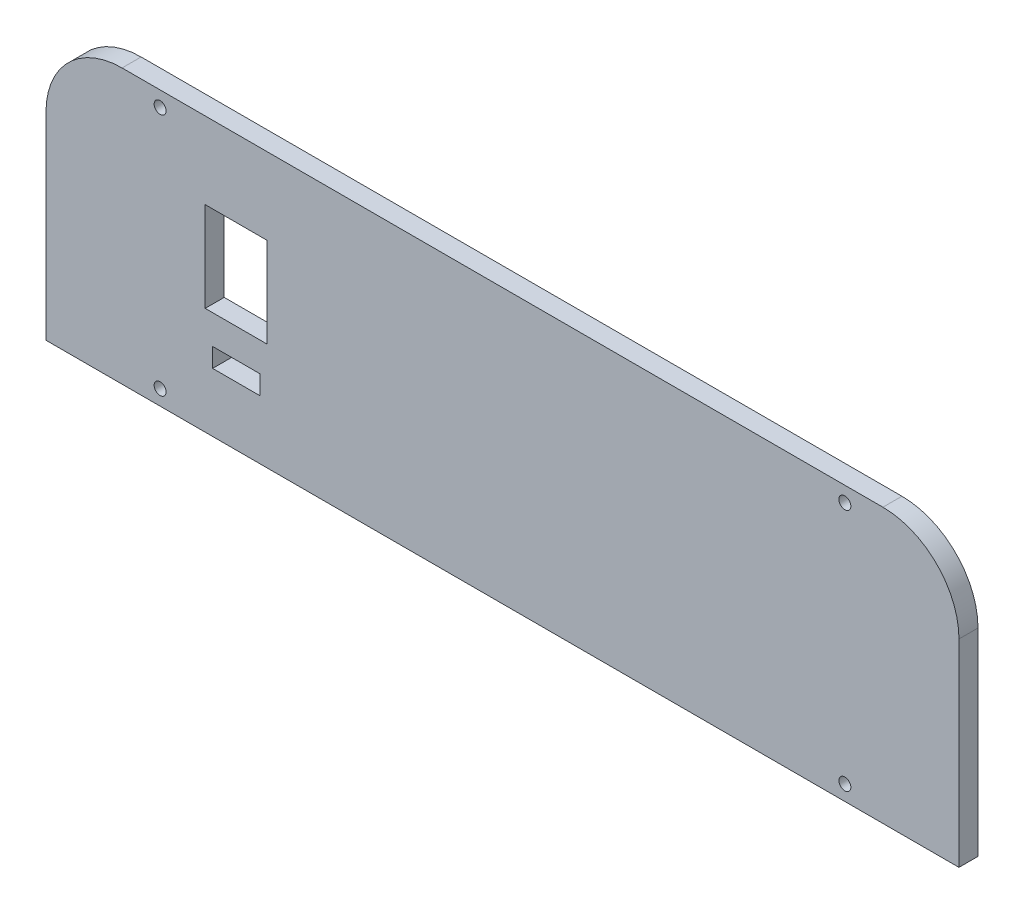
ISO-10303-21;
HEADER;
FILE_DESCRIPTION(('STEP AP214'),'2;1');
FILE_NAME('part.step','',(''),(''),'','','');
FILE_SCHEMA(('AUTOMOTIVE_DESIGN { 1 0 10303 214 1 1 1 1 }'));
ENDSEC;
DATA;
#1=APPLICATION_CONTEXT('core data for automotive mechanical design processes');
#2=APPLICATION_PROTOCOL_DEFINITION('international standard','automotive_design',2000,#1);
#3=PRODUCT_CONTEXT('',#1,'mechanical');
#4=PRODUCT('Part','Part','',(#3));
#5=PRODUCT_RELATED_PRODUCT_CATEGORY('part','',(#4));
#6=PRODUCT_DEFINITION_FORMATION('','',#4);
#7=PRODUCT_DEFINITION_CONTEXT('part definition',#1,'design');
#8=PRODUCT_DEFINITION('design','',#6,#7);
#9=PRODUCT_DEFINITION_SHAPE('','',#8);
#10=(LENGTH_UNIT() NAMED_UNIT(*) SI_UNIT(.MILLI.,.METRE.));
#11=(NAMED_UNIT(*) PLANE_ANGLE_UNIT() SI_UNIT($,.RADIAN.));
#12=(NAMED_UNIT(*) SI_UNIT($,.STERADIAN.) SOLID_ANGLE_UNIT());
#13=UNCERTAINTY_MEASURE_WITH_UNIT(LENGTH_MEASURE(1.E-05),#10,'distance_accuracy_value','');
#14=(GEOMETRIC_REPRESENTATION_CONTEXT(3) GLOBAL_UNCERTAINTY_ASSIGNED_CONTEXT((#13)) GLOBAL_UNIT_ASSIGNED_CONTEXT((#10,
#11,#12)) REPRESENTATION_CONTEXT('',''));
#15=CARTESIAN_POINT('',(0.,0.,0.));
#16=DIRECTION('',(0.,0.,1.));
#17=DIRECTION('',(1.,0.,0.));
#18=AXIS2_PLACEMENT_3D('',#15,#16,#17);
#19=CARTESIAN_POINT('',(76.2,-22.86,3.175));
#20=DIRECTION('',(-1.,0.,0.));
#21=DIRECTION('',(0.,0.,1.));
#22=AXIS2_PLACEMENT_3D('',#19,#20,#21);
#23=PLANE('',#22);
#24=DIRECTION('',(0.,1.,0.));
#25=VECTOR('',#24,1.);
#26=CARTESIAN_POINT('',(76.2,-22.86,0.));
#27=LINE('',#26,#25);
#28=CARTESIAN_POINT('',(76.2,-22.86,0.));
#29=VERTEX_POINT('',#28);
#30=CARTESIAN_POINT('',(76.2,10.16,0.));
#31=VERTEX_POINT('',#30);
#32=EDGE_CURVE('E224',#29,#31,#27,.T.);
#33=ORIENTED_EDGE('',*,*,#32,.T.);
#34=DIRECTION('',(0.,0.,-1.));
#35=VECTOR('',#34,1.);
#36=CARTESIAN_POINT('',(76.2,10.16,3.175));
#37=LINE('',#36,#35);
#38=CARTESIAN_POINT('',(76.2,10.16,3.175));
#39=VERTEX_POINT('',#38);
#40=EDGE_CURVE('E261',#31,#39,#37,.F.);
#41=ORIENTED_EDGE('',*,*,#40,.T.);
#42=DIRECTION('',(0.,1.,0.));
#43=VECTOR('',#42,1.);
#44=CARTESIAN_POINT('',(76.2,-22.86,3.175));
#45=LINE('',#44,#43);
#46=CARTESIAN_POINT('',(76.2,-22.86,3.175));
#47=VERTEX_POINT('',#46);
#48=EDGE_CURVE('E227',#47,#39,#45,.T.);
#49=ORIENTED_EDGE('',*,*,#48,.F.);
#50=DIRECTION('',(0.,0.,-1.));
#51=VECTOR('',#50,1.);
#52=CARTESIAN_POINT('',(76.2,-22.86,3.175));
#53=LINE('',#52,#51);
#54=EDGE_CURVE('E238',#47,#29,#53,.T.);
#55=ORIENTED_EDGE('',*,*,#54,.T.);
#56=EDGE_LOOP('',(#33,#41,#49,#55));
#57=FACE_BOUND('',#56,.T.);
#58=ADVANCED_FACE('F33',(#57),#23,.F.);
#59=CARTESIAN_POINT('',(-76.2,22.86,3.175));
#60=DIRECTION('',(0.,-1.,0.));
#61=DIRECTION('',(0.,0.,-1.));
#62=AXIS2_PLACEMENT_3D('',#59,#60,#61);
#63=PLANE('',#62);
#64=DIRECTION('',(-1.,0.,0.));
#65=VECTOR('',#64,1.);
#66=CARTESIAN_POINT('',(-76.2,22.86,3.175));
#67=LINE('',#66,#65);
#68=CARTESIAN_POINT('',(63.4999999999999,22.86,3.175));
#69=VERTEX_POINT('',#68);
#70=CARTESIAN_POINT('',(-63.5,22.86,3.175));
#71=VERTEX_POINT('',#70);
#72=EDGE_CURVE('E230',#69,#71,#67,.T.);
#73=ORIENTED_EDGE('',*,*,#72,.F.);
#74=DIRECTION('',(0.,0.,-1.));
#75=VECTOR('',#74,1.);
#76=CARTESIAN_POINT('',(63.5,22.86,3.175));
#77=LINE('',#76,#75);
#78=CARTESIAN_POINT('',(63.4999999999999,22.86,0.));
#79=VERTEX_POINT('',#78);
#80=EDGE_CURVE('E254',#69,#79,#77,.T.);
#81=ORIENTED_EDGE('',*,*,#80,.T.);
#82=DIRECTION('',(-1.,0.,0.));
#83=VECTOR('',#82,1.);
#84=CARTESIAN_POINT('',(-76.2,22.86,0.));
#85=LINE('',#84,#83);
#86=CARTESIAN_POINT('',(-63.5,22.86,0.));
#87=VERTEX_POINT('',#86);
#88=EDGE_CURVE('E241',#79,#87,#85,.T.);
#89=ORIENTED_EDGE('',*,*,#88,.T.);
#90=DIRECTION('',(0.,0.,-1.));
#91=VECTOR('',#90,1.);
#92=CARTESIAN_POINT('',(-63.5,22.86,3.175));
#93=LINE('',#92,#91);
#94=EDGE_CURVE('E252',#87,#71,#93,.F.);
#95=ORIENTED_EDGE('',*,*,#94,.T.);
#96=EDGE_LOOP('',(#73,#81,#89,#95));
#97=FACE_BOUND('',#96,.T.);
#98=ADVANCED_FACE('F274',(#97),#63,.F.);
#99=CARTESIAN_POINT('',(-76.2,-22.86,3.175));
#100=DIRECTION('',(1.,0.,0.));
#101=DIRECTION('',(0.,0.,-1.));
#102=AXIS2_PLACEMENT_3D('',#99,#100,#101);
#103=PLANE('',#102);
#104=DIRECTION('',(0.,-1.,0.));
#105=VECTOR('',#104,1.);
#106=CARTESIAN_POINT('',(-76.2,-22.86,3.175));
#107=LINE('',#106,#105);
#108=CARTESIAN_POINT('',(-76.2,10.16,3.175));
#109=VERTEX_POINT('',#108);
#110=CARTESIAN_POINT('',(-76.2,-22.86,3.175));
#111=VERTEX_POINT('',#110);
#112=EDGE_CURVE('E234',#109,#111,#107,.T.);
#113=ORIENTED_EDGE('',*,*,#112,.F.);
#114=DIRECTION('',(0.,0.,-1.));
#115=VECTOR('',#114,1.);
#116=CARTESIAN_POINT('',(-76.2,10.16,3.175));
#117=LINE('',#116,#115);
#118=CARTESIAN_POINT('',(-76.2,10.16,0.));
#119=VERTEX_POINT('',#118);
#120=EDGE_CURVE('E11',#109,#119,#117,.T.);
#121=ORIENTED_EDGE('',*,*,#120,.T.);
#122=DIRECTION('',(0.,-1.,0.));
#123=VECTOR('',#122,1.);
#124=CARTESIAN_POINT('',(-76.2,-22.86,0.));
#125=LINE('',#124,#123);
#126=CARTESIAN_POINT('',(-76.2,-22.86,0.));
#127=VERTEX_POINT('',#126);
#128=EDGE_CURVE('E244',#119,#127,#125,.T.);
#129=ORIENTED_EDGE('',*,*,#128,.T.);
#130=DIRECTION('',(0.,0.,-1.));
#131=VECTOR('',#130,1.);
#132=CARTESIAN_POINT('',(-76.2,-22.86,3.175));
#133=LINE('',#132,#131);
#134=EDGE_CURVE('E249',#111,#127,#133,.T.);
#135=ORIENTED_EDGE('',*,*,#134,.F.);
#136=EDGE_LOOP('',(#113,#121,#129,#135));
#137=FACE_BOUND('',#136,.T.);
#138=ADVANCED_FACE('F290',(#137),#103,.F.);
#139=CARTESIAN_POINT('',(-76.2,-22.86,3.175));
#140=DIRECTION('',(0.,1.,0.));
#141=DIRECTION('',(0.,0.,1.));
#142=AXIS2_PLACEMENT_3D('',#139,#140,#141);
#143=PLANE('',#142);
#144=DIRECTION('',(1.,0.,0.));
#145=VECTOR('',#144,1.);
#146=CARTESIAN_POINT('',(-76.2,-22.86,0.));
#147=LINE('',#146,#145);
#148=EDGE_CURVE('E231',#127,#29,#147,.T.);
#149=ORIENTED_EDGE('',*,*,#148,.T.);
#150=ORIENTED_EDGE('',*,*,#54,.F.);
#151=DIRECTION('',(1.,0.,0.));
#152=VECTOR('',#151,1.);
#153=CARTESIAN_POINT('',(-76.2,-22.86,3.175));
#154=LINE('',#153,#152);
#155=EDGE_CURVE('E236',#111,#47,#154,.T.);
#156=ORIENTED_EDGE('',*,*,#155,.F.);
#157=ORIENTED_EDGE('',*,*,#134,.T.);
#158=EDGE_LOOP('',(#149,#150,#156,#157));
#159=FACE_BOUND('',#158,.T.);
#160=ADVANCED_FACE('F285',(#159),#143,.F.);
#161=CARTESIAN_POINT('',(0.,0.,3.175));
#162=DIRECTION('',(0.,0.,-1.));
#163=DIRECTION('',(-1.,0.,0.));
#164=AXIS2_PLACEMENT_3D('',#161,#162,#163);
#165=PLANE('',#164);
#166=DIRECTION('',(-1.,0.,0.));
#167=VECTOR('',#166,1.);
#168=CARTESIAN_POINT('',(-49.625,10.04,3.175));
#169=LINE('',#168,#167);
#170=CARTESIAN_POINT('',(-39.275,10.04,3.175));
#171=VERTEX_POINT('',#170);
#172=CARTESIAN_POINT('',(-49.625,10.04,3.175));
#173=VERTEX_POINT('',#172);
#174=EDGE_CURVE('E161',#171,#173,#169,.T.);
#175=ORIENTED_EDGE('',*,*,#174,.F.);
#176=DIRECTION('',(0.,1.,0.));
#177=VECTOR('',#176,1.);
#178=CARTESIAN_POINT('',(-39.275,10.04,3.175));
#179=LINE('',#178,#177);
#180=CARTESIAN_POINT('',(-39.275,-4.96,3.175));
#181=VERTEX_POINT('',#180);
#182=EDGE_CURVE('E48',#181,#171,#179,.T.);
#183=ORIENTED_EDGE('',*,*,#182,.F.);
#184=DIRECTION('',(1.,0.,0.));
#185=VECTOR('',#184,1.);
#186=CARTESIAN_POINT('',(-49.625,-4.96,3.175));
#187=LINE('',#186,#185);
#188=CARTESIAN_POINT('',(-49.625,-4.96,3.175));
#189=VERTEX_POINT('',#188);
#190=EDGE_CURVE('E152',#189,#181,#187,.T.);
#191=ORIENTED_EDGE('',*,*,#190,.F.);
#192=DIRECTION('',(0.,-1.,0.));
#193=VECTOR('',#192,1.);
#194=CARTESIAN_POINT('',(-49.625,10.04,3.175));
#195=LINE('',#194,#193);
#196=EDGE_CURVE('E155',#173,#189,#195,.T.);
#197=ORIENTED_EDGE('',*,*,#196,.F.);
#198=EDGE_LOOP('',(#175,#183,#191,#197));
#199=FACE_BOUND('',#198,.T.);
#200=DIRECTION('',(-1.,0.,0.));
#201=VECTOR('',#200,1.);
#202=CARTESIAN_POINT('',(-48.387,-9.8425,3.175));
#203=LINE('',#202,#201);
#204=CARTESIAN_POINT('',(-40.513,-9.8425,3.175));
#205=VERTEX_POINT('',#204);
#206=CARTESIAN_POINT('',(-48.387,-9.8425,3.175));
#207=VERTEX_POINT('',#206);
#208=EDGE_CURVE('E186',#205,#207,#203,.T.);
#209=ORIENTED_EDGE('',*,*,#208,.F.);
#210=DIRECTION('',(0.,1.,0.));
#211=VECTOR('',#210,1.);
#212=CARTESIAN_POINT('',(-40.513,-13.0175,3.175));
#213=LINE('',#212,#211);
#214=CARTESIAN_POINT('',(-40.513,-13.0175,3.175));
#215=VERTEX_POINT('',#214);
#216=EDGE_CURVE('E167',#215,#205,#213,.T.);
#217=ORIENTED_EDGE('',*,*,#216,.F.);
#218=DIRECTION('',(1.,0.,0.));
#219=VECTOR('',#218,1.);
#220=CARTESIAN_POINT('',(-48.387,-13.0175,3.175));
#221=LINE('',#220,#219);
#222=CARTESIAN_POINT('',(-48.387,-13.0175,3.175));
#223=VERTEX_POINT('',#222);
#224=EDGE_CURVE('E175',#223,#215,#221,.T.);
#225=ORIENTED_EDGE('',*,*,#224,.F.);
#226=DIRECTION('',(0.,-1.,0.));
#227=VECTOR('',#226,1.);
#228=CARTESIAN_POINT('',(-48.387,-13.0175,3.175));
#229=LINE('',#228,#227);
#230=EDGE_CURVE('E189',#207,#223,#229,.T.);
#231=ORIENTED_EDGE('',*,*,#230,.F.);
#232=EDGE_LOOP('',(#209,#217,#225,#231));
#233=FACE_BOUND('',#232,.T.);
#234=CARTESIAN_POINT('',(-57.15,20.32,3.175));
#235=DIRECTION('',(0.,0.,1.));
#236=DIRECTION('',(-1.,0.,0.));
#237=AXIS2_PLACEMENT_3D('',#234,#235,#236);
#238=CIRCLE('',#237,0.999998000000009);
#239=CARTESIAN_POINT('',(-58.149998,20.32,3.175));
#240=VERTEX_POINT('',#239);
#241=EDGE_CURVE('E213',#240,#240,#238,.T.);
#242=ORIENTED_EDGE('',*,*,#241,.F.);
#243=EDGE_LOOP('',(#242));
#244=FACE_BOUND('',#243,.T.);
#245=CARTESIAN_POINT('',(57.15,-20.32,3.175));
#246=DIRECTION('',(0.,0.,1.));
#247=DIRECTION('',(-1.,0.,0.));
#248=AXIS2_PLACEMENT_3D('',#245,#246,#247);
#249=CIRCLE('',#248,0.999998000000009);
#250=CARTESIAN_POINT('',(56.150002,-20.32,3.175));
#251=VERTEX_POINT('',#250);
#252=EDGE_CURVE('E206',#251,#251,#249,.T.);
#253=ORIENTED_EDGE('',*,*,#252,.F.);
#254=EDGE_LOOP('',(#253));
#255=FACE_BOUND('',#254,.T.);
#256=CARTESIAN_POINT('',(57.15,20.32,3.175));
#257=DIRECTION('',(0.,0.,1.));
#258=DIRECTION('',(1.,0.,0.));
#259=AXIS2_PLACEMENT_3D('',#256,#257,#258);
#260=CIRCLE('',#259,0.999998000000009);
#261=CARTESIAN_POINT('',(58.149998,20.32,3.175));
#262=VERTEX_POINT('',#261);
#263=EDGE_CURVE('E196',#262,#262,#260,.T.);
#264=ORIENTED_EDGE('',*,*,#263,.F.);
#265=EDGE_LOOP('',(#264));
#266=FACE_BOUND('',#265,.T.);
#267=CARTESIAN_POINT('',(-57.15,-20.32,3.175));
#268=DIRECTION('',(0.,0.,1.));
#269=DIRECTION('',(1.,0.,0.));
#270=AXIS2_PLACEMENT_3D('',#267,#268,#269);
#271=CIRCLE('',#270,0.999998000000009);
#272=CARTESIAN_POINT('',(-56.150002,-20.32,3.175));
#273=VERTEX_POINT('',#272);
#274=EDGE_CURVE('E212',#273,#273,#271,.T.);
#275=ORIENTED_EDGE('',*,*,#274,.F.);
#276=EDGE_LOOP('',(#275));
#277=FACE_BOUND('',#276,.T.);
#278=ORIENTED_EDGE('',*,*,#48,.T.);
#279=CARTESIAN_POINT('',(63.5,10.16,3.175));
#280=DIRECTION('',(0.,0.,-1.));
#281=DIRECTION('',(-1.,0.,0.));
#282=AXIS2_PLACEMENT_3D('',#279,#280,#281);
#283=CIRCLE('',#282,12.7);
#284=EDGE_CURVE('E41',#39,#69,#283,.F.);
#285=ORIENTED_EDGE('',*,*,#284,.T.);
#286=ORIENTED_EDGE('',*,*,#72,.T.);
#287=CARTESIAN_POINT('',(-63.5,10.16,3.175));
#288=DIRECTION('',(0.,0.,-1.));
#289=DIRECTION('',(-1.,0.,0.));
#290=AXIS2_PLACEMENT_3D('',#287,#288,#289);
#291=CIRCLE('',#290,12.7);
#292=EDGE_CURVE('E263',#71,#109,#291,.F.);
#293=ORIENTED_EDGE('',*,*,#292,.T.);
#294=ORIENTED_EDGE('',*,*,#112,.T.);
#295=ORIENTED_EDGE('',*,*,#155,.T.);
#296=EDGE_LOOP('',(#278,#285,#286,#293,#294,#295));
#297=FACE_BOUND('',#296,.T.);
#298=ADVANCED_FACE('F267',(#199,#233,#244,#255,#266,#277,#297),#165,.F.);
#299=CARTESIAN_POINT('',(0.,0.,0.));
#300=DIRECTION('',(0.,0.,-1.));
#301=DIRECTION('',(-1.,0.,0.));
#302=AXIS2_PLACEMENT_3D('',#299,#300,#301);
#303=PLANE('',#302);
#304=DIRECTION('',(0.,1.,0.));
#305=VECTOR('',#304,1.);
#306=CARTESIAN_POINT('',(-39.275,10.04,0.));
#307=LINE('',#306,#305);
#308=CARTESIAN_POINT('',(-39.275,-4.96,0.));
#309=VERTEX_POINT('',#308);
#310=CARTESIAN_POINT('',(-39.275,10.04,0.));
#311=VERTEX_POINT('',#310);
#312=EDGE_CURVE('E136',#309,#311,#307,.T.);
#313=ORIENTED_EDGE('',*,*,#312,.T.);
#314=DIRECTION('',(-1.,0.,0.));
#315=VECTOR('',#314,1.);
#316=CARTESIAN_POINT('',(-49.625,10.04,0.));
#317=LINE('',#316,#315);
#318=CARTESIAN_POINT('',(-49.625,10.04,0.));
#319=VERTEX_POINT('',#318);
#320=EDGE_CURVE('E145',#311,#319,#317,.T.);
#321=ORIENTED_EDGE('',*,*,#320,.T.);
#322=DIRECTION('',(0.,-1.,0.));
#323=VECTOR('',#322,1.);
#324=CARTESIAN_POINT('',(-49.625,10.04,0.));
#325=LINE('',#324,#323);
#326=CARTESIAN_POINT('',(-49.625,-4.96,0.));
#327=VERTEX_POINT('',#326);
#328=EDGE_CURVE('E56',#319,#327,#325,.T.);
#329=ORIENTED_EDGE('',*,*,#328,.T.);
#330=DIRECTION('',(1.,0.,0.));
#331=VECTOR('',#330,1.);
#332=CARTESIAN_POINT('',(-49.625,-4.96,0.));
#333=LINE('',#332,#331);
#334=EDGE_CURVE('E142',#327,#309,#333,.T.);
#335=ORIENTED_EDGE('',*,*,#334,.T.);
#336=EDGE_LOOP('',(#313,#321,#329,#335));
#337=FACE_BOUND('',#336,.T.);
#338=DIRECTION('',(0.,1.,0.));
#339=VECTOR('',#338,1.);
#340=CARTESIAN_POINT('',(-40.513,-13.0175,0.));
#341=LINE('',#340,#339);
#342=CARTESIAN_POINT('',(-40.513,-13.0175,0.));
#343=VERTEX_POINT('',#342);
#344=CARTESIAN_POINT('',(-40.513,-9.8425,0.));
#345=VERTEX_POINT('',#344);
#346=EDGE_CURVE('E171',#343,#345,#341,.T.);
#347=ORIENTED_EDGE('',*,*,#346,.T.);
#348=DIRECTION('',(-1.,0.,0.));
#349=VECTOR('',#348,1.);
#350=CARTESIAN_POINT('',(-48.387,-9.8425,0.));
#351=LINE('',#350,#349);
#352=CARTESIAN_POINT('',(-48.387,-9.8425,0.));
#353=VERTEX_POINT('',#352);
#354=EDGE_CURVE('E174',#345,#353,#351,.T.);
#355=ORIENTED_EDGE('',*,*,#354,.T.);
#356=DIRECTION('',(0.,-1.,0.));
#357=VECTOR('',#356,1.);
#358=CARTESIAN_POINT('',(-48.387,-13.0175,0.));
#359=LINE('',#358,#357);
#360=CARTESIAN_POINT('',(-48.387,-13.0175,0.));
#361=VERTEX_POINT('',#360);
#362=EDGE_CURVE('E178',#353,#361,#359,.T.);
#363=ORIENTED_EDGE('',*,*,#362,.T.);
#364=DIRECTION('',(1.,0.,0.));
#365=VECTOR('',#364,1.);
#366=CARTESIAN_POINT('',(-48.387,-13.0175,0.));
#367=LINE('',#366,#365);
#368=EDGE_CURVE('E181',#361,#343,#367,.T.);
#369=ORIENTED_EDGE('',*,*,#368,.T.);
#370=EDGE_LOOP('',(#347,#355,#363,#369));
#371=FACE_BOUND('',#370,.T.);
#372=CARTESIAN_POINT('',(-57.15,20.32,0.));
#373=DIRECTION('',(0.,0.,1.));
#374=DIRECTION('',(-1.,0.,0.));
#375=AXIS2_PLACEMENT_3D('',#372,#373,#374);
#376=CIRCLE('',#375,0.999998000000009);
#377=CARTESIAN_POINT('',(-58.149998,20.32,0.));
#378=VERTEX_POINT('',#377);
#379=EDGE_CURVE('E209',#378,#378,#376,.T.);
#380=ORIENTED_EDGE('',*,*,#379,.T.);
#381=EDGE_LOOP('',(#380));
#382=FACE_BOUND('',#381,.T.);
#383=CARTESIAN_POINT('',(57.15,-20.32,0.));
#384=DIRECTION('',(0.,0.,1.));
#385=DIRECTION('',(-1.,0.,0.));
#386=AXIS2_PLACEMENT_3D('',#383,#384,#385);
#387=CIRCLE('',#386,0.999998000000009);
#388=CARTESIAN_POINT('',(56.150002,-20.32,0.));
#389=VERTEX_POINT('',#388);
#390=EDGE_CURVE('E216',#389,#389,#387,.T.);
#391=ORIENTED_EDGE('',*,*,#390,.T.);
#392=EDGE_LOOP('',(#391));
#393=FACE_BOUND('',#392,.T.);
#394=CARTESIAN_POINT('',(57.15,20.32,0.));
#395=DIRECTION('',(0.,0.,1.));
#396=DIRECTION('',(1.,0.,0.));
#397=AXIS2_PLACEMENT_3D('',#394,#395,#396);
#398=CIRCLE('',#397,0.999998000000009);
#399=CARTESIAN_POINT('',(58.149998,20.32,0.));
#400=VERTEX_POINT('',#399);
#401=EDGE_CURVE('E203',#400,#400,#398,.T.);
#402=ORIENTED_EDGE('',*,*,#401,.T.);
#403=EDGE_LOOP('',(#402));
#404=FACE_BOUND('',#403,.T.);
#405=CARTESIAN_POINT('',(-57.15,-20.32,0.));
#406=DIRECTION('',(0.,0.,1.));
#407=DIRECTION('',(1.,0.,0.));
#408=AXIS2_PLACEMENT_3D('',#405,#406,#407);
#409=CIRCLE('',#408,0.999998000000009);
#410=CARTESIAN_POINT('',(-56.150002,-20.32,0.));
#411=VERTEX_POINT('',#410);
#412=EDGE_CURVE('E221',#411,#411,#409,.T.);
#413=ORIENTED_EDGE('',*,*,#412,.T.);
#414=EDGE_LOOP('',(#413));
#415=FACE_BOUND('',#414,.T.);
#416=ORIENTED_EDGE('',*,*,#88,.F.);
#417=CARTESIAN_POINT('',(63.5,10.16,0.));
#418=DIRECTION('',(0.,0.,-1.));
#419=DIRECTION('',(-1.,0.,0.));
#420=AXIS2_PLACEMENT_3D('',#417,#418,#419);
#421=CIRCLE('',#420,12.7);
#422=EDGE_CURVE('E259',#79,#31,#421,.T.);
#423=ORIENTED_EDGE('',*,*,#422,.T.);
#424=ORIENTED_EDGE('',*,*,#32,.F.);
#425=ORIENTED_EDGE('',*,*,#148,.F.);
#426=ORIENTED_EDGE('',*,*,#128,.F.);
#427=CARTESIAN_POINT('',(-63.5,10.16,0.));
#428=DIRECTION('',(0.,0.,-1.));
#429=DIRECTION('',(-1.,0.,0.));
#430=AXIS2_PLACEMENT_3D('',#427,#428,#429);
#431=CIRCLE('',#430,12.7);
#432=EDGE_CURVE('E257',#119,#87,#431,.T.);
#433=ORIENTED_EDGE('',*,*,#432,.T.);
#434=EDGE_LOOP('',(#416,#423,#424,#425,#426,#433));
#435=FACE_BOUND('',#434,.T.);
#436=ADVANCED_FACE('F149',(#337,#371,#382,#393,#404,#415,#435),#303,.T.);
#437=CARTESIAN_POINT('',(63.5,10.16,3.175));
#438=DIRECTION('',(0.,0.,-1.));
#439=DIRECTION('',(-1.,0.,0.));
#440=AXIS2_PLACEMENT_3D('',#437,#438,#439);
#441=CYLINDRICAL_SURFACE('',#440,12.7);
#442=ORIENTED_EDGE('',*,*,#284,.F.);
#443=ORIENTED_EDGE('',*,*,#40,.F.);
#444=ORIENTED_EDGE('',*,*,#422,.F.);
#445=ORIENTED_EDGE('',*,*,#80,.F.);
#446=EDGE_LOOP('',(#442,#443,#444,#445));
#447=FACE_BOUND('',#446,.T.);
#448=ADVANCED_FACE('F277',(#447),#441,.T.);
#449=CARTESIAN_POINT('',(-63.5,10.16,3.175));
#450=DIRECTION('',(0.,0.,-1.));
#451=DIRECTION('',(-1.,0.,0.));
#452=AXIS2_PLACEMENT_3D('',#449,#450,#451);
#453=CYLINDRICAL_SURFACE('',#452,12.7);
#454=ORIENTED_EDGE('',*,*,#292,.F.);
#455=ORIENTED_EDGE('',*,*,#94,.F.);
#456=ORIENTED_EDGE('',*,*,#432,.F.);
#457=ORIENTED_EDGE('',*,*,#120,.F.);
#458=EDGE_LOOP('',(#454,#455,#456,#457));
#459=FACE_BOUND('',#458,.T.);
#460=ADVANCED_FACE('F35',(#459),#453,.T.);
#461=CARTESIAN_POINT('',(-57.15,-20.32,0.));
#462=DIRECTION('',(0.,0.,1.));
#463=DIRECTION('',(1.,0.,0.));
#464=AXIS2_PLACEMENT_3D('',#461,#462,#463);
#465=CYLINDRICAL_SURFACE('',#464,0.999998000000009);
#466=ORIENTED_EDGE('',*,*,#412,.F.);
#467=EDGE_LOOP('',(#466));
#468=FACE_BOUND('',#467,.T.);
#469=ORIENTED_EDGE('',*,*,#274,.T.);
#470=EDGE_LOOP('',(#469));
#471=FACE_BOUND('',#470,.T.);
#472=ADVANCED_FACE('F294',(#468,#471),#465,.F.);
#473=CARTESIAN_POINT('',(57.15,20.32,0.));
#474=DIRECTION('',(0.,0.,1.));
#475=DIRECTION('',(1.,0.,0.));
#476=AXIS2_PLACEMENT_3D('',#473,#474,#475);
#477=CYLINDRICAL_SURFACE('',#476,0.999998000000009);
#478=ORIENTED_EDGE('',*,*,#401,.F.);
#479=EDGE_LOOP('',(#478));
#480=FACE_BOUND('',#479,.T.);
#481=ORIENTED_EDGE('',*,*,#263,.T.);
#482=EDGE_LOOP('',(#481));
#483=FACE_BOUND('',#482,.T.);
#484=ADVANCED_FACE('F299',(#480,#483),#477,.F.);
#485=CARTESIAN_POINT('',(57.15,-20.32,0.));
#486=DIRECTION('',(0.,0.,1.));
#487=DIRECTION('',(1.,0.,0.));
#488=AXIS2_PLACEMENT_3D('',#485,#486,#487);
#489=CYLINDRICAL_SURFACE('',#488,0.999998000000009);
#490=ORIENTED_EDGE('',*,*,#390,.F.);
#491=EDGE_LOOP('',(#490));
#492=FACE_BOUND('',#491,.T.);
#493=ORIENTED_EDGE('',*,*,#252,.T.);
#494=EDGE_LOOP('',(#493));
#495=FACE_BOUND('',#494,.T.);
#496=ADVANCED_FACE('F318',(#492,#495),#489,.F.);
#497=CARTESIAN_POINT('',(-57.15,20.32,0.));
#498=DIRECTION('',(0.,0.,1.));
#499=DIRECTION('',(1.,0.,0.));
#500=AXIS2_PLACEMENT_3D('',#497,#498,#499);
#501=CYLINDRICAL_SURFACE('',#500,0.999998000000009);
#502=ORIENTED_EDGE('',*,*,#379,.F.);
#503=EDGE_LOOP('',(#502));
#504=FACE_BOUND('',#503,.T.);
#505=ORIENTED_EDGE('',*,*,#241,.T.);
#506=EDGE_LOOP('',(#505));
#507=FACE_BOUND('',#506,.T.);
#508=ADVANCED_FACE('F321',(#504,#507),#501,.F.);
#509=CARTESIAN_POINT('',(-40.513,-13.0175,0.));
#510=DIRECTION('',(1.,0.,0.));
#511=DIRECTION('',(0.,0.,-1.));
#512=AXIS2_PLACEMENT_3D('',#509,#510,#511);
#513=PLANE('',#512);
#514=ORIENTED_EDGE('',*,*,#216,.T.);
#515=DIRECTION('',(0.,0.,1.));
#516=VECTOR('',#515,1.);
#517=CARTESIAN_POINT('',(-40.513,-9.8425,0.));
#518=LINE('',#517,#516);
#519=EDGE_CURVE('E184',#345,#205,#518,.T.);
#520=ORIENTED_EDGE('',*,*,#519,.F.);
#521=ORIENTED_EDGE('',*,*,#346,.F.);
#522=DIRECTION('',(0.,0.,1.));
#523=VECTOR('',#522,1.);
#524=CARTESIAN_POINT('',(-40.513,-13.0175,0.));
#525=LINE('',#524,#523);
#526=EDGE_CURVE('E194',#343,#215,#525,.T.);
#527=ORIENTED_EDGE('',*,*,#526,.T.);
#528=EDGE_LOOP('',(#514,#520,#521,#527));
#529=FACE_BOUND('',#528,.T.);
#530=ADVANCED_FACE('F325',(#529),#513,.F.);
#531=CARTESIAN_POINT('',(-48.387,-13.0175,0.));
#532=DIRECTION('',(0.,-1.,0.));
#533=DIRECTION('',(0.,0.,-1.));
#534=AXIS2_PLACEMENT_3D('',#531,#532,#533);
#535=PLANE('',#534);
#536=ORIENTED_EDGE('',*,*,#224,.T.);
#537=ORIENTED_EDGE('',*,*,#526,.F.);
#538=ORIENTED_EDGE('',*,*,#368,.F.);
#539=DIRECTION('',(0.,0.,1.));
#540=VECTOR('',#539,1.);
#541=CARTESIAN_POINT('',(-48.387,-13.0175,0.));
#542=LINE('',#541,#540);
#543=EDGE_CURVE('E197',#361,#223,#542,.T.);
#544=ORIENTED_EDGE('',*,*,#543,.T.);
#545=EDGE_LOOP('',(#536,#537,#538,#544));
#546=FACE_BOUND('',#545,.T.);
#547=ADVANCED_FACE('F332',(#546),#535,.F.);
#548=CARTESIAN_POINT('',(-48.387,-13.0175,0.));
#549=DIRECTION('',(-1.,0.,0.));
#550=DIRECTION('',(0.,0.,1.));
#551=AXIS2_PLACEMENT_3D('',#548,#549,#550);
#552=PLANE('',#551);
#553=ORIENTED_EDGE('',*,*,#230,.T.);
#554=ORIENTED_EDGE('',*,*,#543,.F.);
#555=ORIENTED_EDGE('',*,*,#362,.F.);
#556=DIRECTION('',(0.,0.,1.));
#557=VECTOR('',#556,1.);
#558=CARTESIAN_POINT('',(-48.387,-9.8425,0.));
#559=LINE('',#558,#557);
#560=EDGE_CURVE('E199',#353,#207,#559,.T.);
#561=ORIENTED_EDGE('',*,*,#560,.T.);
#562=EDGE_LOOP('',(#553,#554,#555,#561));
#563=FACE_BOUND('',#562,.T.);
#564=ADVANCED_FACE('F337',(#563),#552,.F.);
#565=CARTESIAN_POINT('',(-48.387,-9.8425,0.));
#566=DIRECTION('',(0.,1.,0.));
#567=DIRECTION('',(0.,0.,1.));
#568=AXIS2_PLACEMENT_3D('',#565,#566,#567);
#569=PLANE('',#568);
#570=ORIENTED_EDGE('',*,*,#208,.T.);
#571=ORIENTED_EDGE('',*,*,#560,.F.);
#572=ORIENTED_EDGE('',*,*,#354,.F.);
#573=ORIENTED_EDGE('',*,*,#519,.T.);
#574=EDGE_LOOP('',(#570,#571,#572,#573));
#575=FACE_BOUND('',#574,.T.);
#576=ADVANCED_FACE('F334',(#575),#569,.F.);
#577=CARTESIAN_POINT('',(-39.275,10.04,0.));
#578=DIRECTION('',(1.,0.,0.));
#579=DIRECTION('',(0.,0.,-1.));
#580=AXIS2_PLACEMENT_3D('',#577,#578,#579);
#581=PLANE('',#580);
#582=ORIENTED_EDGE('',*,*,#182,.T.);
#583=DIRECTION('',(0.,0.,1.));
#584=VECTOR('',#583,1.);
#585=CARTESIAN_POINT('',(-39.275,10.04,0.));
#586=LINE('',#585,#584);
#587=EDGE_CURVE('E132',#311,#171,#586,.T.);
#588=ORIENTED_EDGE('',*,*,#587,.F.);
#589=ORIENTED_EDGE('',*,*,#312,.F.);
#590=DIRECTION('',(0.,0.,1.));
#591=VECTOR('',#590,1.);
#592=CARTESIAN_POINT('',(-39.275,-4.96,0.));
#593=LINE('',#592,#591);
#594=EDGE_CURVE('E165',#309,#181,#593,.T.);
#595=ORIENTED_EDGE('',*,*,#594,.T.);
#596=EDGE_LOOP('',(#582,#588,#589,#595));
#597=FACE_BOUND('',#596,.T.);
#598=ADVANCED_FACE('F134',(#597),#581,.F.);
#599=CARTESIAN_POINT('',(-49.625,-4.96,0.));
#600=DIRECTION('',(0.,-1.,0.));
#601=DIRECTION('',(0.,0.,-1.));
#602=AXIS2_PLACEMENT_3D('',#599,#600,#601);
#603=PLANE('',#602);
#604=ORIENTED_EDGE('',*,*,#190,.T.);
#605=ORIENTED_EDGE('',*,*,#594,.F.);
#606=ORIENTED_EDGE('',*,*,#334,.F.);
#607=DIRECTION('',(0.,0.,1.));
#608=VECTOR('',#607,1.);
#609=CARTESIAN_POINT('',(-49.625,-4.96,0.));
#610=LINE('',#609,#608);
#611=EDGE_CURVE('E168',#327,#189,#610,.T.);
#612=ORIENTED_EDGE('',*,*,#611,.T.);
#613=EDGE_LOOP('',(#604,#605,#606,#612));
#614=FACE_BOUND('',#613,.T.);
#615=ADVANCED_FACE('F347',(#614),#603,.F.);
#616=CARTESIAN_POINT('',(-49.625,10.04,0.));
#617=DIRECTION('',(-1.,0.,0.));
#618=DIRECTION('',(0.,-1.,0.));
#619=AXIS2_PLACEMENT_3D('',#616,#617,#618);
#620=PLANE('',#619);
#621=ORIENTED_EDGE('',*,*,#196,.T.);
#622=ORIENTED_EDGE('',*,*,#611,.F.);
#623=ORIENTED_EDGE('',*,*,#328,.F.);
#624=DIRECTION('',(0.,0.,1.));
#625=VECTOR('',#624,1.);
#626=CARTESIAN_POINT('',(-49.625,10.04,0.));
#627=LINE('',#626,#625);
#628=EDGE_CURVE('E141',#319,#173,#627,.T.);
#629=ORIENTED_EDGE('',*,*,#628,.T.);
#630=EDGE_LOOP('',(#621,#622,#623,#629));
#631=FACE_BOUND('',#630,.T.);
#632=ADVANCED_FACE('F350',(#631),#620,.F.);
#633=CARTESIAN_POINT('',(-49.625,10.04,0.));
#634=DIRECTION('',(0.,1.,0.));
#635=DIRECTION('',(0.,0.,1.));
#636=AXIS2_PLACEMENT_3D('',#633,#634,#635);
#637=PLANE('',#636);
#638=ORIENTED_EDGE('',*,*,#174,.T.);
#639=ORIENTED_EDGE('',*,*,#628,.F.);
#640=ORIENTED_EDGE('',*,*,#320,.F.);
#641=ORIENTED_EDGE('',*,*,#587,.T.);
#642=EDGE_LOOP('',(#638,#639,#640,#641));
#643=FACE_BOUND('',#642,.T.);
#644=ADVANCED_FACE('F146',(#643),#637,.F.);
#645=CLOSED_SHELL('',(#58,#98,#138,#160,#298,#436,#448,#460,#472,#484,#496,#508,#530,#547,#564,
#576,#598,#615,#632,#644));
#646=MANIFOLD_SOLID_BREP('B2',#645);
#647=ADVANCED_BREP_SHAPE_REPRESENTATION('',(#18,#646),#14);
#648=SHAPE_DEFINITION_REPRESENTATION(#9,#647);
ENDSEC;
END-ISO-10303-21;
